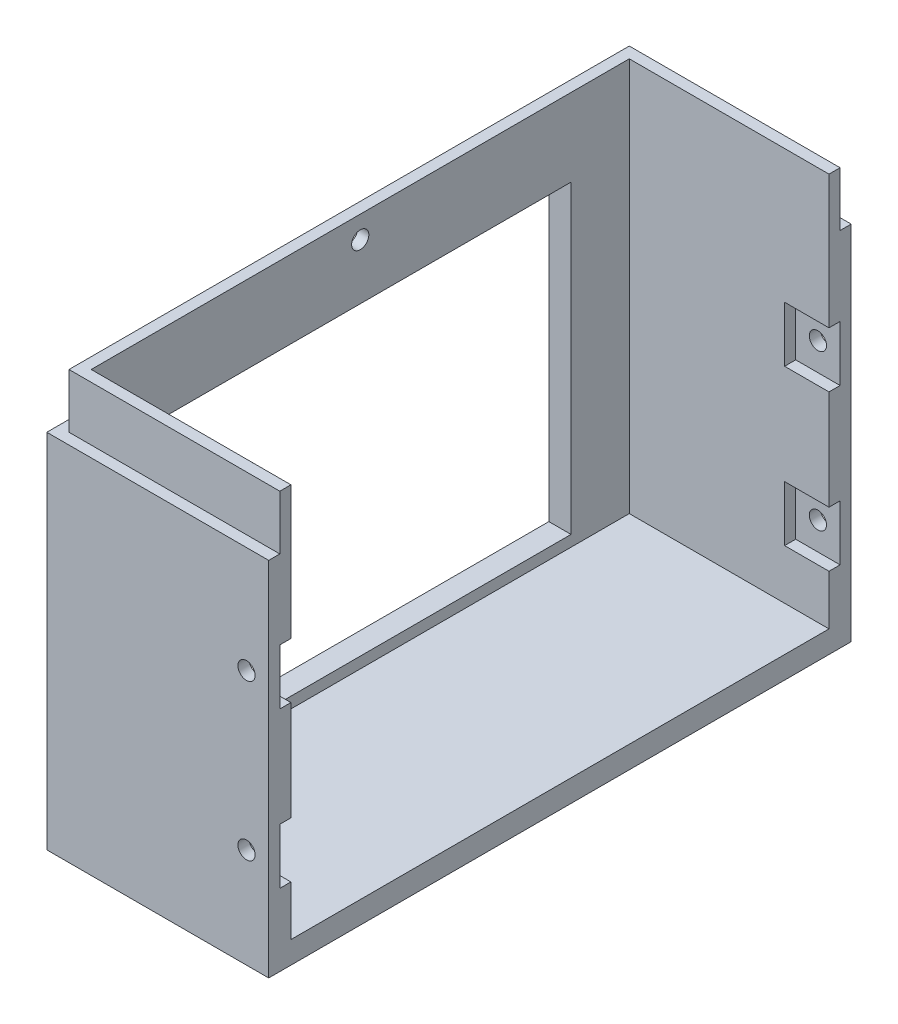
ISO-10303-21;
HEADER;
FILE_DESCRIPTION(('STEP AP214'),'2;1');
FILE_NAME('part.step','',(''),(''),'','','');
FILE_SCHEMA(('AUTOMOTIVE_DESIGN { 1 0 10303 214 1 1 1 1 }'));
ENDSEC;
DATA;
#1=APPLICATION_CONTEXT('core data for automotive mechanical design processes');
#2=APPLICATION_PROTOCOL_DEFINITION('international standard','automotive_design',2000,#1);
#3=PRODUCT_CONTEXT('',#1,'mechanical');
#4=PRODUCT('Part','Part','',(#3));
#5=PRODUCT_RELATED_PRODUCT_CATEGORY('part','',(#4));
#6=PRODUCT_DEFINITION_FORMATION('','',#4);
#7=PRODUCT_DEFINITION_CONTEXT('part definition',#1,'design');
#8=PRODUCT_DEFINITION('design','',#6,#7);
#9=PRODUCT_DEFINITION_SHAPE('','',#8);
#10=(LENGTH_UNIT() NAMED_UNIT(*) SI_UNIT(.MILLI.,.METRE.));
#11=(NAMED_UNIT(*) PLANE_ANGLE_UNIT() SI_UNIT($,.RADIAN.));
#12=(NAMED_UNIT(*) SI_UNIT($,.STERADIAN.) SOLID_ANGLE_UNIT());
#13=UNCERTAINTY_MEASURE_WITH_UNIT(LENGTH_MEASURE(1.E-05),#10,'distance_accuracy_value','');
#14=(GEOMETRIC_REPRESENTATION_CONTEXT(3) GLOBAL_UNCERTAINTY_ASSIGNED_CONTEXT((#13)) GLOBAL_UNIT_ASSIGNED_CONTEXT((#10,
#11,#12)) REPRESENTATION_CONTEXT('',''));
#15=CARTESIAN_POINT('',(0.,0.,0.));
#16=DIRECTION('',(0.,0.,1.));
#17=DIRECTION('',(1.,0.,0.));
#18=AXIS2_PLACEMENT_3D('',#15,#16,#17);
#19=CARTESIAN_POINT('',(16.,46.,52.5));
#20=DIRECTION('',(0.,0.,-1.));
#21=DIRECTION('',(-1.,0.,0.));
#22=AXIS2_PLACEMENT_3D('',#19,#20,#21);
#23=CYLINDRICAL_SURFACE('',#22,1.55);
#24=CARTESIAN_POINT('',(16.,46.,-52.5));
#25=DIRECTION('',(0.,0.,-1.));
#26=DIRECTION('',(-1.,0.,0.));
#27=AXIS2_PLACEMENT_3D('',#24,#25,#26);
#28=CIRCLE('',#27,1.55);
#29=CARTESIAN_POINT('',(14.45,46.,-52.5));
#30=VERTEX_POINT('',#29);
#31=EDGE_CURVE('E413',#30,#30,#28,.T.);
#32=ORIENTED_EDGE('',*,*,#31,.T.);
#33=EDGE_LOOP('',(#32));
#34=FACE_BOUND('',#33,.T.);
#35=CARTESIAN_POINT('',(16.,46.,-50.5));
#36=DIRECTION('',(0.,0.,1.));
#37=DIRECTION('',(1.,0.,0.));
#38=AXIS2_PLACEMENT_3D('',#35,#36,#37);
#39=CIRCLE('',#38,1.55);
#40=CARTESIAN_POINT('',(17.55,46.,-50.5));
#41=VERTEX_POINT('',#40);
#42=EDGE_CURVE('E42',#41,#41,#39,.F.);
#43=ORIENTED_EDGE('',*,*,#42,.F.);
#44=EDGE_LOOP('',(#43));
#45=FACE_BOUND('',#44,.T.);
#46=ADVANCED_FACE('F38',(#34,#45),#23,.F.);
#47=CARTESIAN_POINT('',(16.,18.,52.5));
#48=DIRECTION('',(0.,0.,-1.));
#49=DIRECTION('',(-1.,0.,0.));
#50=AXIS2_PLACEMENT_3D('',#47,#48,#49);
#51=CYLINDRICAL_SURFACE('',#50,1.55);
#52=CARTESIAN_POINT('',(16.,18.,-52.5));
#53=DIRECTION('',(0.,0.,-1.));
#54=DIRECTION('',(-1.,0.,0.));
#55=AXIS2_PLACEMENT_3D('',#52,#53,#54);
#56=CIRCLE('',#55,1.55);
#57=CARTESIAN_POINT('',(14.45,18.,-52.5));
#58=VERTEX_POINT('',#57);
#59=EDGE_CURVE('E405',#58,#58,#56,.T.);
#60=ORIENTED_EDGE('',*,*,#59,.T.);
#61=EDGE_LOOP('',(#60));
#62=FACE_BOUND('',#61,.T.);
#63=CARTESIAN_POINT('',(16.,18.,-50.5));
#64=DIRECTION('',(0.,0.,1.));
#65=DIRECTION('',(1.,0.,0.));
#66=AXIS2_PLACEMENT_3D('',#63,#64,#65);
#67=CIRCLE('',#66,1.55);
#68=CARTESIAN_POINT('',(17.55,18.,-50.5));
#69=VERTEX_POINT('',#68);
#70=EDGE_CURVE('E308',#69,#69,#67,.F.);
#71=ORIENTED_EDGE('',*,*,#70,.F.);
#72=EDGE_LOOP('',(#71));
#73=FACE_BOUND('',#72,.T.);
#74=ADVANCED_FACE('F521',(#62,#73),#51,.F.);
#75=CARTESIAN_POINT('',(16.,46.,52.5));
#76=DIRECTION('',(0.,0.,-1.));
#77=DIRECTION('',(-1.,0.,0.));
#78=AXIS2_PLACEMENT_3D('',#75,#76,#77);
#79=CIRCLE('',#78,1.55);
#80=CARTESIAN_POINT('',(14.45,46.,52.5));
#81=VERTEX_POINT('',#80);
#82=EDGE_CURVE('E409',#81,#81,#79,.T.);
#83=ORIENTED_EDGE('',*,*,#82,.F.);
#84=EDGE_LOOP('',(#83));
#85=FACE_BOUND('',#84,.T.);
#86=CARTESIAN_POINT('',(16.,46.,50.5));
#87=DIRECTION('',(0.,0.,-1.));
#88=DIRECTION('',(0.,1.,0.));
#89=AXIS2_PLACEMENT_3D('',#86,#87,#88);
#90=CIRCLE('',#89,1.55);
#91=CARTESIAN_POINT('',(16.,47.55,50.5));
#92=VERTEX_POINT('',#91);
#93=EDGE_CURVE('E416',#92,#92,#90,.F.);
#94=ORIENTED_EDGE('',*,*,#93,.F.);
#95=EDGE_LOOP('',(#94));
#96=FACE_BOUND('',#95,.T.);
#97=ADVANCED_FACE('F524',(#85,#96),#23,.F.);
#98=CARTESIAN_POINT('',(0.,75.,0.));
#99=DIRECTION('',(0.,1.,0.));
#100=DIRECTION('',(0.,0.,1.));
#101=AXIS2_PLACEMENT_3D('',#98,#99,#100);
#102=PLANE('',#101);
#103=DIRECTION('',(1.,0.,0.));
#104=VECTOR('',#103,1.);
#105=CARTESIAN_POINT('',(20.,75.,-50.5));
#106=LINE('',#105,#104);
#107=CARTESIAN_POINT('',(-18.,75.,-50.5));
#108=VERTEX_POINT('',#107);
#109=CARTESIAN_POINT('',(20.,75.,-50.5));
#110=VERTEX_POINT('',#109);
#111=EDGE_CURVE('E434',#108,#110,#106,.T.);
#112=ORIENTED_EDGE('',*,*,#111,.F.);
#113=DIRECTION('',(0.,0.,-1.));
#114=VECTOR('',#113,1.);
#115=CARTESIAN_POINT('',(-18.,75.,-50.5));
#116=LINE('',#115,#114);
#117=CARTESIAN_POINT('',(-18.,75.,50.5));
#118=VERTEX_POINT('',#117);
#119=EDGE_CURVE('E425',#118,#108,#116,.T.);
#120=ORIENTED_EDGE('',*,*,#119,.F.);
#121=DIRECTION('',(-1.,0.,0.));
#122=VECTOR('',#121,1.);
#123=CARTESIAN_POINT('',(20.,75.,50.5));
#124=LINE('',#123,#122);
#125=CARTESIAN_POINT('',(20.,75.,50.5));
#126=VERTEX_POINT('',#125);
#127=EDGE_CURVE('E443',#126,#118,#124,.T.);
#128=ORIENTED_EDGE('',*,*,#127,.F.);
#129=DIRECTION('',(0.,0.,-1.));
#130=VECTOR('',#129,1.);
#131=CARTESIAN_POINT('',(20.,75.,-52.5));
#132=LINE('',#131,#130);
#133=CARTESIAN_POINT('',(20.,75.,48.5));
#134=VERTEX_POINT('',#133);
#135=EDGE_CURVE('E490',#126,#134,#132,.T.);
#136=ORIENTED_EDGE('',*,*,#135,.T.);
#137=DIRECTION('',(1.,0.,0.));
#138=VECTOR('',#137,1.);
#139=CARTESIAN_POINT('',(-16.,75.,48.5));
#140=LINE('',#139,#138);
#141=CARTESIAN_POINT('',(-16.,75.,48.5));
#142=VERTEX_POINT('',#141);
#143=EDGE_CURVE('E479',#142,#134,#140,.T.);
#144=ORIENTED_EDGE('',*,*,#143,.F.);
#145=DIRECTION('',(0.,0.,1.));
#146=VECTOR('',#145,1.);
#147=CARTESIAN_POINT('',(-16.,75.,48.5));
#148=LINE('',#147,#146);
#149=CARTESIAN_POINT('',(-16.,75.,-48.5));
#150=VERTEX_POINT('',#149);
#151=EDGE_CURVE('E464',#150,#142,#148,.T.);
#152=ORIENTED_EDGE('',*,*,#151,.F.);
#153=DIRECTION('',(1.,0.,0.));
#154=VECTOR('',#153,1.);
#155=CARTESIAN_POINT('',(-16.,75.,-48.5));
#156=LINE('',#155,#154);
#157=CARTESIAN_POINT('',(20.,75.,-48.5));
#158=VERTEX_POINT('',#157);
#159=EDGE_CURVE('E483',#150,#158,#156,.T.);
#160=ORIENTED_EDGE('',*,*,#159,.T.);
#161=EDGE_CURVE('E493',#158,#110,#132,.T.);
#162=ORIENTED_EDGE('',*,*,#161,.T.);
#163=EDGE_LOOP('',(#112,#120,#128,#136,#144,#152,#160,#162));
#164=FACE_BOUND('',#163,.T.);
#165=ADVANCED_FACE('F533',(#164),#102,.T.);
#166=CARTESIAN_POINT('',(0.,0.,50.5));
#167=DIRECTION('',(0.,0.,-1.));
#168=DIRECTION('',(-1.,0.,0.));
#169=AXIS2_PLACEMENT_3D('',#166,#167,#168);
#170=PLANE('',#169);
#171=DIRECTION('',(0.,1.,0.));
#172=VECTOR('',#171,1.);
#173=CARTESIAN_POINT('',(-18.,75.,50.5));
#174=LINE('',#173,#172);
#175=CARTESIAN_POINT('',(-18.,65.2,50.5));
#176=VERTEX_POINT('',#175);
#177=EDGE_CURVE('E423',#176,#118,#174,.T.);
#178=ORIENTED_EDGE('',*,*,#177,.F.);
#179=DIRECTION('',(1.,0.,0.));
#180=VECTOR('',#179,1.);
#181=CARTESIAN_POINT('',(20.,65.2,50.5));
#182=LINE('',#181,#180);
#183=CARTESIAN_POINT('',(20.,65.2,50.5));
#184=VERTEX_POINT('',#183);
#185=EDGE_CURVE('E446',#176,#184,#182,.T.);
#186=ORIENTED_EDGE('',*,*,#185,.T.);
#187=DIRECTION('',(0.,1.,0.));
#188=VECTOR('',#187,1.);
#189=CARTESIAN_POINT('',(20.,75.,50.5));
#190=LINE('',#189,#188);
#191=EDGE_CURVE('E441',#184,#126,#190,.T.);
#192=ORIENTED_EDGE('',*,*,#191,.T.);
#193=ORIENTED_EDGE('',*,*,#127,.T.);
#194=EDGE_LOOP('',(#178,#186,#192,#193));
#195=FACE_BOUND('',#194,.T.);
#196=ADVANCED_FACE('F538',(#195),#170,.F.);
#197=CARTESIAN_POINT('',(0.,0.,-50.5));
#198=DIRECTION('',(0.,0.,-1.));
#199=DIRECTION('',(-1.,0.,0.));
#200=AXIS2_PLACEMENT_3D('',#197,#198,#199);
#201=PLANE('',#200);
#202=DIRECTION('',(-1.,0.,0.));
#203=VECTOR('',#202,1.);
#204=CARTESIAN_POINT('',(20.,65.2,-50.5));
#205=LINE('',#204,#203);
#206=CARTESIAN_POINT('',(20.,65.2,-50.5));
#207=VERTEX_POINT('',#206);
#208=CARTESIAN_POINT('',(-18.,65.2,-50.5));
#209=VERTEX_POINT('',#208);
#210=EDGE_CURVE('E431',#207,#209,#205,.T.);
#211=ORIENTED_EDGE('',*,*,#210,.T.);
#212=DIRECTION('',(0.,-1.,0.));
#213=VECTOR('',#212,1.);
#214=CARTESIAN_POINT('',(-18.,75.,-50.5));
#215=LINE('',#214,#213);
#216=EDGE_CURVE('E412',#108,#209,#215,.T.);
#217=ORIENTED_EDGE('',*,*,#216,.F.);
#218=ORIENTED_EDGE('',*,*,#111,.T.);
#219=DIRECTION('',(0.,-1.,0.));
#220=VECTOR('',#219,1.);
#221=CARTESIAN_POINT('',(20.,75.,-50.5));
#222=LINE('',#221,#220);
#223=EDGE_CURVE('E428',#110,#207,#222,.T.);
#224=ORIENTED_EDGE('',*,*,#223,.T.);
#225=EDGE_LOOP('',(#211,#217,#218,#224));
#226=FACE_BOUND('',#225,.T.);
#227=ADVANCED_FACE('F621',(#226),#201,.T.);
#228=CARTESIAN_POINT('',(20.,75.,-52.5));
#229=DIRECTION('',(-1.,0.,0.));
#230=DIRECTION('',(0.,0.,1.));
#231=AXIS2_PLACEMENT_3D('',#228,#229,#230);
#232=PLANE('',#231);
#233=DIRECTION('',(0.,1.,0.));
#234=VECTOR('',#233,1.);
#235=CARTESIAN_POINT('',(20.,51.,-50.5));
#236=LINE('',#235,#234);
#237=CARTESIAN_POINT('',(20.,41.,-50.5));
#238=VERTEX_POINT('',#237);
#239=CARTESIAN_POINT('',(20.,51.,-50.5));
#240=VERTEX_POINT('',#239);
#241=EDGE_CURVE('E283',#238,#240,#236,.T.);
#242=ORIENTED_EDGE('',*,*,#241,.F.);
#243=DIRECTION('',(0.,0.,1.));
#244=VECTOR('',#243,1.);
#245=CARTESIAN_POINT('',(20.,41.,-50.5));
#246=LINE('',#245,#244);
#247=CARTESIAN_POINT('',(20.,41.,-48.5));
#248=VERTEX_POINT('',#247);
#249=EDGE_CURVE('E305',#238,#248,#246,.T.);
#250=ORIENTED_EDGE('',*,*,#249,.T.);
#251=DIRECTION('',(0.,1.,0.));
#252=VECTOR('',#251,1.);
#253=CARTESIAN_POINT('',(20.,75.,-48.5));
#254=LINE('',#253,#252);
#255=CARTESIAN_POINT('',(20.,23.,-48.5));
#256=VERTEX_POINT('',#255);
#257=EDGE_CURVE('E478',#256,#248,#254,.T.);
#258=ORIENTED_EDGE('',*,*,#257,.F.);
#259=DIRECTION('',(0.,0.,1.));
#260=VECTOR('',#259,1.);
#261=CARTESIAN_POINT('',(20.,23.,-50.5));
#262=LINE('',#261,#260);
#263=CARTESIAN_POINT('',(20.,23.,-50.5));
#264=VERTEX_POINT('',#263);
#265=EDGE_CURVE('E327',#264,#256,#262,.T.);
#266=ORIENTED_EDGE('',*,*,#265,.F.);
#267=DIRECTION('',(0.,1.,0.));
#268=VECTOR('',#267,1.);
#269=CARTESIAN_POINT('',(20.,23.,-50.5));
#270=LINE('',#269,#268);
#271=CARTESIAN_POINT('',(20.,13.,-50.5));
#272=VERTEX_POINT('',#271);
#273=EDGE_CURVE('E314',#272,#264,#270,.T.);
#274=ORIENTED_EDGE('',*,*,#273,.F.);
#275=DIRECTION('',(0.,0.,1.));
#276=VECTOR('',#275,1.);
#277=CARTESIAN_POINT('',(20.,13.,-50.5));
#278=LINE('',#277,#276);
#279=CARTESIAN_POINT('',(20.,13.,-48.5));
#280=VERTEX_POINT('',#279);
#281=EDGE_CURVE('E301',#272,#280,#278,.T.);
#282=ORIENTED_EDGE('',*,*,#281,.T.);
#283=CARTESIAN_POINT('',(20.,4.,-48.5));
#284=VERTEX_POINT('',#283);
#285=EDGE_CURVE('E459',#284,#280,#254,.T.);
#286=ORIENTED_EDGE('',*,*,#285,.F.);
#287=DIRECTION('',(0.,0.,-1.));
#288=VECTOR('',#287,1.);
#289=CARTESIAN_POINT('',(20.,4.,48.5));
#290=LINE('',#289,#288);
#291=CARTESIAN_POINT('',(20.,4.,48.5));
#292=VERTEX_POINT('',#291);
#293=EDGE_CURVE('E471',#292,#284,#290,.T.);
#294=ORIENTED_EDGE('',*,*,#293,.F.);
#295=DIRECTION('',(0.,-1.,0.));
#296=VECTOR('',#295,1.);
#297=CARTESIAN_POINT('',(20.,75.,48.5));
#298=LINE('',#297,#296);
#299=CARTESIAN_POINT('',(20.,13.,48.5));
#300=VERTEX_POINT('',#299);
#301=EDGE_CURVE('E453',#300,#292,#298,.T.);
#302=ORIENTED_EDGE('',*,*,#301,.F.);
#303=DIRECTION('',(0.,0.,-1.));
#304=VECTOR('',#303,1.);
#305=CARTESIAN_POINT('',(20.,13.,50.5));
#306=LINE('',#305,#304);
#307=CARTESIAN_POINT('',(20.,13.,50.5));
#308=VERTEX_POINT('',#307);
#309=EDGE_CURVE('E361',#308,#300,#306,.T.);
#310=ORIENTED_EDGE('',*,*,#309,.F.);
#311=DIRECTION('',(0.,-1.,0.));
#312=VECTOR('',#311,1.);
#313=CARTESIAN_POINT('',(20.,23.,50.5));
#314=LINE('',#313,#312);
#315=CARTESIAN_POINT('',(20.,23.,50.5));
#316=VERTEX_POINT('',#315);
#317=EDGE_CURVE('E348',#316,#308,#314,.T.);
#318=ORIENTED_EDGE('',*,*,#317,.F.);
#319=DIRECTION('',(0.,0.,-1.));
#320=VECTOR('',#319,1.);
#321=CARTESIAN_POINT('',(20.,23.,50.5));
#322=LINE('',#321,#320);
#323=CARTESIAN_POINT('',(20.,23.,48.5));
#324=VERTEX_POINT('',#323);
#325=EDGE_CURVE('E370',#316,#324,#322,.T.);
#326=ORIENTED_EDGE('',*,*,#325,.T.);
#327=CARTESIAN_POINT('',(20.,41.,48.5));
#328=VERTEX_POINT('',#327);
#329=EDGE_CURVE('E472',#328,#324,#298,.T.);
#330=ORIENTED_EDGE('',*,*,#329,.F.);
#331=DIRECTION('',(0.,0.,-1.));
#332=VECTOR('',#331,1.);
#333=CARTESIAN_POINT('',(20.,41.,50.5));
#334=LINE('',#333,#332);
#335=CARTESIAN_POINT('',(20.,41.,50.5));
#336=VERTEX_POINT('',#335);
#337=EDGE_CURVE('E398',#336,#328,#334,.T.);
#338=ORIENTED_EDGE('',*,*,#337,.F.);
#339=DIRECTION('',(0.,-1.,0.));
#340=VECTOR('',#339,1.);
#341=CARTESIAN_POINT('',(20.,51.,50.5));
#342=LINE('',#341,#340);
#343=CARTESIAN_POINT('',(20.,51.,50.5));
#344=VERTEX_POINT('',#343);
#345=EDGE_CURVE('E386',#344,#336,#342,.T.);
#346=ORIENTED_EDGE('',*,*,#345,.F.);
#347=DIRECTION('',(0.,0.,-1.));
#348=VECTOR('',#347,1.);
#349=CARTESIAN_POINT('',(20.,51.,50.5));
#350=LINE('',#349,#348);
#351=CARTESIAN_POINT('',(20.,51.,48.5));
#352=VERTEX_POINT('',#351);
#353=EDGE_CURVE('E400',#344,#352,#350,.T.);
#354=ORIENTED_EDGE('',*,*,#353,.T.);
#355=EDGE_CURVE('E468',#134,#352,#298,.T.);
#356=ORIENTED_EDGE('',*,*,#355,.F.);
#357=ORIENTED_EDGE('',*,*,#135,.F.);
#358=ORIENTED_EDGE('',*,*,#191,.F.);
#359=DIRECTION('',(0.,0.,1.));
#360=VECTOR('',#359,1.);
#361=CARTESIAN_POINT('',(20.,65.2,50.5));
#362=LINE('',#361,#360);
#363=CARTESIAN_POINT('',(20.,65.2,52.5));
#364=VERTEX_POINT('',#363);
#365=EDGE_CURVE('E450',#184,#364,#362,.T.);
#366=ORIENTED_EDGE('',*,*,#365,.T.);
#367=DIRECTION('',(0.,-1.,0.));
#368=VECTOR('',#367,1.);
#369=CARTESIAN_POINT('',(20.,75.,52.5));
#370=LINE('',#369,#368);
#371=CARTESIAN_POINT('',(20.,0.,52.5));
#372=VERTEX_POINT('',#371);
#373=EDGE_CURVE('E492',#364,#372,#370,.T.);
#374=ORIENTED_EDGE('',*,*,#373,.T.);
#375=DIRECTION('',(0.,0.,-1.));
#376=VECTOR('',#375,1.);
#377=CARTESIAN_POINT('',(20.,0.,-52.5));
#378=LINE('',#377,#376);
#379=CARTESIAN_POINT('',(20.,0.,-52.5));
#380=VERTEX_POINT('',#379);
#381=EDGE_CURVE('E482',#372,#380,#378,.T.);
#382=ORIENTED_EDGE('',*,*,#381,.T.);
#383=DIRECTION('',(0.,-1.,0.));
#384=VECTOR('',#383,1.);
#385=CARTESIAN_POINT('',(20.,75.,-52.5));
#386=LINE('',#385,#384);
#387=CARTESIAN_POINT('',(20.,65.2,-52.5));
#388=VERTEX_POINT('',#387);
#389=EDGE_CURVE('E11',#388,#380,#386,.T.);
#390=ORIENTED_EDGE('',*,*,#389,.F.);
#391=DIRECTION('',(0.,0.,-1.));
#392=VECTOR('',#391,1.);
#393=CARTESIAN_POINT('',(20.,65.2,-50.5));
#394=LINE('',#393,#392);
#395=EDGE_CURVE('E436',#207,#388,#394,.T.);
#396=ORIENTED_EDGE('',*,*,#395,.F.);
#397=ORIENTED_EDGE('',*,*,#223,.F.);
#398=ORIENTED_EDGE('',*,*,#161,.F.);
#399=CARTESIAN_POINT('',(20.,51.,-48.5));
#400=VERTEX_POINT('',#399);
#401=EDGE_CURVE('E475',#400,#158,#254,.T.);
#402=ORIENTED_EDGE('',*,*,#401,.F.);
#403=DIRECTION('',(0.,0.,1.));
#404=VECTOR('',#403,1.);
#405=CARTESIAN_POINT('',(20.,51.,-50.5));
#406=LINE('',#405,#404);
#407=EDGE_CURVE('E296',#240,#400,#406,.T.);
#408=ORIENTED_EDGE('',*,*,#407,.F.);
#409=EDGE_LOOP('',(#242,#250,#258,#266,#274,#282,#286,#294,#302,#310,#318,#326,#330,#338,#346,
#354,#356,#357,#358,#366,#374,#382,#390,#396,#397,#398,#402,#408));
#410=FACE_BOUND('',#409,.T.);
#411=ADVANCED_FACE('F40',(#410),#232,.F.);
#412=CARTESIAN_POINT('',(-20.,75.,-52.5));
#413=DIRECTION('',(0.,0.,1.));
#414=DIRECTION('',(1.,0.,0.));
#415=AXIS2_PLACEMENT_3D('',#412,#413,#414);
#416=PLANE('',#415);
#417=ORIENTED_EDGE('',*,*,#59,.F.);
#418=EDGE_LOOP('',(#417));
#419=FACE_BOUND('',#418,.T.);
#420=ORIENTED_EDGE('',*,*,#31,.F.);
#421=EDGE_LOOP('',(#420));
#422=FACE_BOUND('',#421,.T.);
#423=DIRECTION('',(0.,-1.,0.));
#424=VECTOR('',#423,1.);
#425=CARTESIAN_POINT('',(-20.,75.,-52.5));
#426=LINE('',#425,#424);
#427=CARTESIAN_POINT('',(-20.,65.2,-52.5));
#428=VERTEX_POINT('',#427);
#429=CARTESIAN_POINT('',(-20.,0.,-52.5));
#430=VERTEX_POINT('',#429);
#431=EDGE_CURVE('E47',#428,#430,#426,.T.);
#432=ORIENTED_EDGE('',*,*,#431,.F.);
#433=DIRECTION('',(-1.,0.,0.));
#434=VECTOR('',#433,1.);
#435=CARTESIAN_POINT('',(20.,65.2,-52.5));
#436=LINE('',#435,#434);
#437=EDGE_CURVE('E427',#388,#428,#436,.T.);
#438=ORIENTED_EDGE('',*,*,#437,.F.);
#439=ORIENTED_EDGE('',*,*,#389,.T.);
#440=DIRECTION('',(-1.,0.,0.));
#441=VECTOR('',#440,1.);
#442=CARTESIAN_POINT('',(-20.,0.,-52.5));
#443=LINE('',#442,#441);
#444=EDGE_CURVE('E496',#380,#430,#443,.T.);
#445=ORIENTED_EDGE('',*,*,#444,.T.);
#446=EDGE_LOOP('',(#432,#438,#439,#445));
#447=FACE_BOUND('',#446,.T.);
#448=ADVANCED_FACE('F614',(#419,#422,#447),#416,.F.);
#449=CARTESIAN_POINT('',(-20.,75.,-52.5));
#450=DIRECTION('',(1.,0.,0.));
#451=DIRECTION('',(0.,0.,-1.));
#452=AXIS2_PLACEMENT_3D('',#449,#450,#451);
#453=PLANE('',#452);
#454=DIRECTION('',(0.,0.,-1.));
#455=VECTOR('',#454,1.);
#456=CARTESIAN_POINT('',(-20.,61.,-38.));
#457=LINE('',#456,#455);
#458=CARTESIAN_POINT('',(-20.,61.,38.));
#459=VERTEX_POINT('',#458);
#460=CARTESIAN_POINT('',(-20.,61.,-38.));
#461=VERTEX_POINT('',#460);
#462=EDGE_CURVE('E267',#459,#461,#457,.T.);
#463=ORIENTED_EDGE('',*,*,#462,.F.);
#464=DIRECTION('',(0.,1.,0.));
#465=VECTOR('',#464,1.);
#466=CARTESIAN_POINT('',(-20.,61.,38.));
#467=LINE('',#466,#465);
#468=CARTESIAN_POINT('',(-20.,6.,38.));
#469=VERTEX_POINT('',#468);
#470=EDGE_CURVE('E55',#469,#459,#467,.T.);
#471=ORIENTED_EDGE('',*,*,#470,.F.);
#472=DIRECTION('',(0.,0.,1.));
#473=VECTOR('',#472,1.);
#474=CARTESIAN_POINT('',(-20.,6.,-38.));
#475=LINE('',#474,#473);
#476=CARTESIAN_POINT('',(-20.,6.,-38.));
#477=VERTEX_POINT('',#476);
#478=EDGE_CURVE('E260',#477,#469,#475,.T.);
#479=ORIENTED_EDGE('',*,*,#478,.F.);
#480=DIRECTION('',(0.,-1.,0.));
#481=VECTOR('',#480,1.);
#482=CARTESIAN_POINT('',(-20.,61.,-38.));
#483=LINE('',#482,#481);
#484=EDGE_CURVE('E274',#461,#477,#483,.T.);
#485=ORIENTED_EDGE('',*,*,#484,.F.);
#486=EDGE_LOOP('',(#463,#471,#479,#485));
#487=FACE_BOUND('',#486,.T.);
#488=DIRECTION('',(0.,0.,1.));
#489=VECTOR('',#488,1.);
#490=CARTESIAN_POINT('',(-20.,65.2,50.5));
#491=LINE('',#490,#489);
#492=CARTESIAN_POINT('',(-20.,65.2,52.5));
#493=VERTEX_POINT('',#492);
#494=EDGE_CURVE('E448',#428,#493,#491,.T.);
#495=ORIENTED_EDGE('',*,*,#494,.F.);
#496=ORIENTED_EDGE('',*,*,#431,.T.);
#497=DIRECTION('',(0.,0.,1.));
#498=VECTOR('',#497,1.);
#499=CARTESIAN_POINT('',(-20.,0.,-52.5));
#500=LINE('',#499,#498);
#501=CARTESIAN_POINT('',(-20.,0.,52.5));
#502=VERTEX_POINT('',#501);
#503=EDGE_CURVE('E499',#430,#502,#500,.T.);
#504=ORIENTED_EDGE('',*,*,#503,.T.);
#505=DIRECTION('',(0.,-1.,0.));
#506=VECTOR('',#505,1.);
#507=CARTESIAN_POINT('',(-20.,75.,52.5));
#508=LINE('',#507,#506);
#509=EDGE_CURVE('E506',#493,#502,#508,.T.);
#510=ORIENTED_EDGE('',*,*,#509,.F.);
#511=EDGE_LOOP('',(#495,#496,#504,#510));
#512=FACE_BOUND('',#511,.T.);
#513=ADVANCED_FACE('F591',(#487,#512),#453,.F.);
#514=CARTESIAN_POINT('',(-20.,75.,52.5));
#515=DIRECTION('',(0.,0.,-1.));
#516=DIRECTION('',(-1.,0.,0.));
#517=AXIS2_PLACEMENT_3D('',#514,#515,#516);
#518=PLANE('',#517);
#519=CARTESIAN_POINT('',(16.,18.,52.5));
#520=DIRECTION('',(0.,0.,-1.));
#521=DIRECTION('',(-1.,0.,0.));
#522=AXIS2_PLACEMENT_3D('',#519,#520,#521);
#523=CIRCLE('',#522,1.55);
#524=CARTESIAN_POINT('',(14.45,18.,52.5));
#525=VERTEX_POINT('',#524);
#526=EDGE_CURVE('E408',#525,#525,#523,.T.);
#527=ORIENTED_EDGE('',*,*,#526,.T.);
#528=EDGE_LOOP('',(#527));
#529=FACE_BOUND('',#528,.T.);
#530=ORIENTED_EDGE('',*,*,#82,.T.);
#531=EDGE_LOOP('',(#530));
#532=FACE_BOUND('',#531,.T.);
#533=ORIENTED_EDGE('',*,*,#373,.F.);
#534=DIRECTION('',(1.,0.,0.));
#535=VECTOR('',#534,1.);
#536=CARTESIAN_POINT('',(20.,65.2,52.5));
#537=LINE('',#536,#535);
#538=EDGE_CURVE('E440',#493,#364,#537,.T.);
#539=ORIENTED_EDGE('',*,*,#538,.F.);
#540=ORIENTED_EDGE('',*,*,#509,.T.);
#541=DIRECTION('',(1.,0.,0.));
#542=VECTOR('',#541,1.);
#543=CARTESIAN_POINT('',(-20.,0.,52.5));
#544=LINE('',#543,#542);
#545=EDGE_CURVE('E502',#502,#372,#544,.T.);
#546=ORIENTED_EDGE('',*,*,#545,.T.);
#547=EDGE_LOOP('',(#533,#539,#540,#546));
#548=FACE_BOUND('',#547,.T.);
#549=ADVANCED_FACE('F587',(#529,#532,#548),#518,.F.);
#550=CARTESIAN_POINT('',(0.,0.,0.));
#551=DIRECTION('',(0.,1.,0.));
#552=DIRECTION('',(0.,0.,1.));
#553=AXIS2_PLACEMENT_3D('',#550,#551,#552);
#554=PLANE('',#553);
#555=ORIENTED_EDGE('',*,*,#381,.F.);
#556=ORIENTED_EDGE('',*,*,#545,.F.);
#557=ORIENTED_EDGE('',*,*,#503,.F.);
#558=ORIENTED_EDGE('',*,*,#444,.F.);
#559=EDGE_LOOP('',(#555,#556,#557,#558));
#560=FACE_BOUND('',#559,.T.);
#561=ADVANCED_FACE('F590',(#560),#554,.F.);
#562=CARTESIAN_POINT('',(-16.,75.,48.5));
#563=DIRECTION('',(0.,0.,1.));
#564=DIRECTION('',(1.,0.,0.));
#565=AXIS2_PLACEMENT_3D('',#562,#563,#564);
#566=PLANE('',#565);
#567=ORIENTED_EDGE('',*,*,#329,.T.);
#568=DIRECTION('',(1.,0.,0.));
#569=VECTOR('',#568,1.);
#570=CARTESIAN_POINT('',(12.,23.,48.5));
#571=LINE('',#570,#569);
#572=CARTESIAN_POINT('',(12.,23.,48.5));
#573=VERTEX_POINT('',#572);
#574=EDGE_CURVE('E352',#573,#324,#571,.T.);
#575=ORIENTED_EDGE('',*,*,#574,.F.);
#576=DIRECTION('',(0.,1.,0.));
#577=VECTOR('',#576,1.);
#578=CARTESIAN_POINT('',(12.,23.,48.5));
#579=LINE('',#578,#577);
#580=CARTESIAN_POINT('',(12.,13.,48.5));
#581=VERTEX_POINT('',#580);
#582=EDGE_CURVE('E365',#581,#573,#579,.T.);
#583=ORIENTED_EDGE('',*,*,#582,.F.);
#584=DIRECTION('',(-1.,0.,0.));
#585=VECTOR('',#584,1.);
#586=CARTESIAN_POINT('',(12.,13.,48.5));
#587=LINE('',#586,#585);
#588=EDGE_CURVE('E362',#300,#581,#587,.T.);
#589=ORIENTED_EDGE('',*,*,#588,.F.);
#590=ORIENTED_EDGE('',*,*,#301,.T.);
#591=DIRECTION('',(1.,0.,0.));
#592=VECTOR('',#591,1.);
#593=CARTESIAN_POINT('',(-16.,4.,48.5));
#594=LINE('',#593,#592);
#595=CARTESIAN_POINT('',(-16.,4.,48.5));
#596=VERTEX_POINT('',#595);
#597=EDGE_CURVE('E467',#596,#292,#594,.T.);
#598=ORIENTED_EDGE('',*,*,#597,.F.);
#599=DIRECTION('',(0.,-1.,0.));
#600=VECTOR('',#599,1.);
#601=CARTESIAN_POINT('',(-16.,75.,48.5));
#602=LINE('',#601,#600);
#603=EDGE_CURVE('E455',#142,#596,#602,.T.);
#604=ORIENTED_EDGE('',*,*,#603,.F.);
#605=ORIENTED_EDGE('',*,*,#143,.T.);
#606=ORIENTED_EDGE('',*,*,#355,.T.);
#607=DIRECTION('',(1.,0.,0.));
#608=VECTOR('',#607,1.);
#609=CARTESIAN_POINT('',(20.,51.,48.5));
#610=LINE('',#609,#608);
#611=CARTESIAN_POINT('',(12.,51.,48.5));
#612=VERTEX_POINT('',#611);
#613=EDGE_CURVE('E393',#612,#352,#610,.T.);
#614=ORIENTED_EDGE('',*,*,#613,.F.);
#615=DIRECTION('',(0.,1.,0.));
#616=VECTOR('',#615,1.);
#617=CARTESIAN_POINT('',(12.,51.,48.5));
#618=LINE('',#617,#616);
#619=CARTESIAN_POINT('',(12.,41.,48.5));
#620=VERTEX_POINT('',#619);
#621=EDGE_CURVE('E344',#620,#612,#618,.T.);
#622=ORIENTED_EDGE('',*,*,#621,.F.);
#623=DIRECTION('',(-1.,0.,0.));
#624=VECTOR('',#623,1.);
#625=CARTESIAN_POINT('',(20.,41.,48.5));
#626=LINE('',#625,#624);
#627=EDGE_CURVE('E383',#328,#620,#626,.T.);
#628=ORIENTED_EDGE('',*,*,#627,.F.);
#629=EDGE_LOOP('',(#567,#575,#583,#589,#590,#598,#604,#605,#606,#614,#622,#628));
#630=FACE_BOUND('',#629,.T.);
#631=ADVANCED_FACE('F691',(#630),#566,.F.);
#632=CARTESIAN_POINT('',(-16.,75.,-48.5));
#633=DIRECTION('',(0.,0.,-1.));
#634=DIRECTION('',(-1.,0.,0.));
#635=AXIS2_PLACEMENT_3D('',#632,#633,#634);
#636=PLANE('',#635);
#637=ORIENTED_EDGE('',*,*,#257,.T.);
#638=DIRECTION('',(1.,0.,0.));
#639=VECTOR('',#638,1.);
#640=CARTESIAN_POINT('',(12.,41.,-48.5));
#641=LINE('',#640,#639);
#642=CARTESIAN_POINT('',(12.,41.,-48.5));
#643=VERTEX_POINT('',#642);
#644=EDGE_CURVE('E287',#643,#248,#641,.T.);
#645=ORIENTED_EDGE('',*,*,#644,.F.);
#646=DIRECTION('',(0.,-1.,0.));
#647=VECTOR('',#646,1.);
#648=CARTESIAN_POINT('',(12.,51.,-48.5));
#649=LINE('',#648,#647);
#650=CARTESIAN_POINT('',(12.,51.,-48.5));
#651=VERTEX_POINT('',#650);
#652=EDGE_CURVE('E300',#651,#643,#649,.T.);
#653=ORIENTED_EDGE('',*,*,#652,.F.);
#654=DIRECTION('',(-1.,0.,0.));
#655=VECTOR('',#654,1.);
#656=CARTESIAN_POINT('',(12.,51.,-48.5));
#657=LINE('',#656,#655);
#658=EDGE_CURVE('E297',#400,#651,#657,.T.);
#659=ORIENTED_EDGE('',*,*,#658,.F.);
#660=ORIENTED_EDGE('',*,*,#401,.T.);
#661=ORIENTED_EDGE('',*,*,#159,.F.);
#662=DIRECTION('',(0.,1.,0.));
#663=VECTOR('',#662,1.);
#664=CARTESIAN_POINT('',(-16.,75.,-48.5));
#665=LINE('',#664,#663);
#666=CARTESIAN_POINT('',(-16.,4.,-48.5));
#667=VERTEX_POINT('',#666);
#668=EDGE_CURVE('E462',#667,#150,#665,.T.);
#669=ORIENTED_EDGE('',*,*,#668,.F.);
#670=DIRECTION('',(1.,0.,0.));
#671=VECTOR('',#670,1.);
#672=CARTESIAN_POINT('',(-16.,4.,-48.5));
#673=LINE('',#672,#671);
#674=EDGE_CURVE('E486',#667,#284,#673,.T.);
#675=ORIENTED_EDGE('',*,*,#674,.T.);
#676=ORIENTED_EDGE('',*,*,#285,.T.);
#677=DIRECTION('',(1.,0.,0.));
#678=VECTOR('',#677,1.);
#679=CARTESIAN_POINT('',(12.,13.,-48.5));
#680=LINE('',#679,#678);
#681=CARTESIAN_POINT('',(12.,13.,-48.5));
#682=VERTEX_POINT('',#681);
#683=EDGE_CURVE('E318',#682,#280,#680,.T.);
#684=ORIENTED_EDGE('',*,*,#683,.F.);
#685=DIRECTION('',(0.,-1.,0.));
#686=VECTOR('',#685,1.);
#687=CARTESIAN_POINT('',(12.,23.,-48.5));
#688=LINE('',#687,#686);
#689=CARTESIAN_POINT('',(12.,23.,-48.5));
#690=VERTEX_POINT('',#689);
#691=EDGE_CURVE('E330',#690,#682,#688,.T.);
#692=ORIENTED_EDGE('',*,*,#691,.F.);
#693=DIRECTION('',(-1.,0.,0.));
#694=VECTOR('',#693,1.);
#695=CARTESIAN_POINT('',(12.,23.,-48.5));
#696=LINE('',#695,#694);
#697=EDGE_CURVE('E254',#256,#690,#696,.T.);
#698=ORIENTED_EDGE('',*,*,#697,.F.);
#699=EDGE_LOOP('',(#637,#645,#653,#659,#660,#661,#669,#675,#676,#684,#692,#698));
#700=FACE_BOUND('',#699,.T.);
#701=ADVANCED_FACE('F635',(#700),#636,.F.);
#702=CARTESIAN_POINT('',(-16.,4.,48.5));
#703=DIRECTION('',(0.,-1.,0.));
#704=DIRECTION('',(0.,0.,-1.));
#705=AXIS2_PLACEMENT_3D('',#702,#703,#704);
#706=PLANE('',#705);
#707=ORIENTED_EDGE('',*,*,#293,.T.);
#708=ORIENTED_EDGE('',*,*,#674,.F.);
#709=DIRECTION('',(0.,0.,-1.));
#710=VECTOR('',#709,1.);
#711=CARTESIAN_POINT('',(-16.,4.,48.5));
#712=LINE('',#711,#710);
#713=EDGE_CURVE('E458',#596,#667,#712,.T.);
#714=ORIENTED_EDGE('',*,*,#713,.F.);
#715=ORIENTED_EDGE('',*,*,#597,.T.);
#716=EDGE_LOOP('',(#707,#708,#714,#715));
#717=FACE_BOUND('',#716,.T.);
#718=ADVANCED_FACE('F703',(#717),#706,.F.);
#719=CARTESIAN_POINT('',(-16.,0.,0.));
#720=DIRECTION('',(1.,0.,0.));
#721=DIRECTION('',(0.,0.,-1.));
#722=AXIS2_PLACEMENT_3D('',#719,#720,#721);
#723=PLANE('',#722);
#724=DIRECTION('',(0.,1.,0.));
#725=VECTOR('',#724,1.);
#726=CARTESIAN_POINT('',(-16.,61.,38.));
#727=LINE('',#726,#725);
#728=CARTESIAN_POINT('',(-16.,6.,38.));
#729=VERTEX_POINT('',#728);
#730=CARTESIAN_POINT('',(-16.,61.,38.));
#731=VERTEX_POINT('',#730);
#732=EDGE_CURVE('E258',#729,#731,#727,.T.);
#733=ORIENTED_EDGE('',*,*,#732,.T.);
#734=DIRECTION('',(0.,0.,-1.));
#735=VECTOR('',#734,1.);
#736=CARTESIAN_POINT('',(-16.,61.,-38.));
#737=LINE('',#736,#735);
#738=CARTESIAN_POINT('',(-16.,61.,-38.));
#739=VERTEX_POINT('',#738);
#740=EDGE_CURVE('E247',#731,#739,#737,.T.);
#741=ORIENTED_EDGE('',*,*,#740,.T.);
#742=DIRECTION('',(0.,-1.,0.));
#743=VECTOR('',#742,1.);
#744=CARTESIAN_POINT('',(-16.,61.,-38.));
#745=LINE('',#744,#743);
#746=CARTESIAN_POINT('',(-16.,6.00000000000001,-38.));
#747=VERTEX_POINT('',#746);
#748=EDGE_CURVE('E269',#739,#747,#745,.T.);
#749=ORIENTED_EDGE('',*,*,#748,.T.);
#750=DIRECTION('',(0.,0.,1.));
#751=VECTOR('',#750,1.);
#752=CARTESIAN_POINT('',(-16.,6.,-38.));
#753=LINE('',#752,#751);
#754=EDGE_CURVE('E265',#747,#729,#753,.T.);
#755=ORIENTED_EDGE('',*,*,#754,.T.);
#756=EDGE_LOOP('',(#733,#741,#749,#755));
#757=FACE_BOUND('',#756,.T.);
#758=CARTESIAN_POINT('',(-16.,71.,0.));
#759=DIRECTION('',(-1.,0.,0.));
#760=DIRECTION('',(0.,0.,1.));
#761=AXIS2_PLACEMENT_3D('',#758,#759,#760);
#762=CIRCLE('',#761,1.55);
#763=CARTESIAN_POINT('',(-16.,71.,1.55));
#764=VERTEX_POINT('',#763);
#765=EDGE_CURVE('E341',#764,#764,#762,.T.);
#766=ORIENTED_EDGE('',*,*,#765,.T.);
#767=EDGE_LOOP('',(#766));
#768=FACE_BOUND('',#767,.T.);
#769=ORIENTED_EDGE('',*,*,#603,.T.);
#770=ORIENTED_EDGE('',*,*,#713,.T.);
#771=ORIENTED_EDGE('',*,*,#668,.T.);
#772=ORIENTED_EDGE('',*,*,#151,.T.);
#773=EDGE_LOOP('',(#769,#770,#771,#772));
#774=FACE_BOUND('',#773,.T.);
#775=ADVANCED_FACE('F263',(#757,#768,#774),#723,.T.);
#776=CARTESIAN_POINT('',(20.,65.2,50.5));
#777=DIRECTION('',(0.,-1.,0.));
#778=DIRECTION('',(0.,0.,-1.));
#779=AXIS2_PLACEMENT_3D('',#776,#777,#778);
#780=PLANE('',#779);
#781=ORIENTED_EDGE('',*,*,#538,.T.);
#782=ORIENTED_EDGE('',*,*,#365,.F.);
#783=ORIENTED_EDGE('',*,*,#185,.F.);
#784=DIRECTION('',(0.,0.,1.));
#785=VECTOR('',#784,1.);
#786=CARTESIAN_POINT('',(-18.,65.2,-50.5));
#787=LINE('',#786,#785);
#788=EDGE_CURVE('E421',#209,#176,#787,.T.);
#789=ORIENTED_EDGE('',*,*,#788,.F.);
#790=ORIENTED_EDGE('',*,*,#210,.F.);
#791=ORIENTED_EDGE('',*,*,#395,.T.);
#792=ORIENTED_EDGE('',*,*,#437,.T.);
#793=ORIENTED_EDGE('',*,*,#494,.T.);
#794=EDGE_LOOP('',(#781,#782,#783,#789,#790,#791,#792,#793));
#795=FACE_BOUND('',#794,.T.);
#796=ADVANCED_FACE('F581',(#795),#780,.F.);
#797=CARTESIAN_POINT('',(-18.,0.,0.));
#798=DIRECTION('',(-1.,0.,0.));
#799=DIRECTION('',(0.,0.,1.));
#800=AXIS2_PLACEMENT_3D('',#797,#798,#799);
#801=PLANE('',#800);
#802=CARTESIAN_POINT('',(-18.,71.,0.));
#803=DIRECTION('',(-1.,0.,0.));
#804=DIRECTION('',(0.,0.,1.));
#805=AXIS2_PLACEMENT_3D('',#802,#803,#804);
#806=CIRCLE('',#805,1.55);
#807=CARTESIAN_POINT('',(-18.,71.,1.55));
#808=VERTEX_POINT('',#807);
#809=EDGE_CURVE('E345',#808,#808,#806,.T.);
#810=ORIENTED_EDGE('',*,*,#809,.F.);
#811=EDGE_LOOP('',(#810));
#812=FACE_BOUND('',#811,.T.);
#813=ORIENTED_EDGE('',*,*,#216,.T.);
#814=ORIENTED_EDGE('',*,*,#788,.T.);
#815=ORIENTED_EDGE('',*,*,#177,.T.);
#816=ORIENTED_EDGE('',*,*,#119,.T.);
#817=EDGE_LOOP('',(#813,#814,#815,#816));
#818=FACE_BOUND('',#817,.T.);
#819=ADVANCED_FACE('F572',(#812,#818),#801,.T.);
#820=CARTESIAN_POINT('',(16.,18.,50.5));
#821=DIRECTION('',(0.,0.,1.));
#822=DIRECTION('',(1.,0.,0.));
#823=AXIS2_PLACEMENT_3D('',#820,#821,#822);
#824=CIRCLE('',#823,1.55);
#825=CARTESIAN_POINT('',(17.55,18.,50.5));
#826=VERTEX_POINT('',#825);
#827=EDGE_CURVE('E373',#826,#826,#824,.F.);
#828=ORIENTED_EDGE('',*,*,#827,.T.);
#829=EDGE_LOOP('',(#828));
#830=FACE_BOUND('',#829,.T.);
#831=ORIENTED_EDGE('',*,*,#526,.F.);
#832=EDGE_LOOP('',(#831));
#833=FACE_BOUND('',#832,.T.);
#834=ADVANCED_FACE('F530',(#830,#833),#51,.F.);
#835=CARTESIAN_POINT('',(0.,0.,50.5));
#836=DIRECTION('',(0.,0.,1.));
#837=DIRECTION('',(1.,0.,0.));
#838=AXIS2_PLACEMENT_3D('',#835,#836,#837);
#839=PLANE('',#838);
#840=ORIENTED_EDGE('',*,*,#317,.T.);
#841=DIRECTION('',(-1.,0.,0.));
#842=VECTOR('',#841,1.);
#843=CARTESIAN_POINT('',(12.,13.,50.5));
#844=LINE('',#843,#842);
#845=CARTESIAN_POINT('',(12.,13.,50.5));
#846=VERTEX_POINT('',#845);
#847=EDGE_CURVE('E351',#308,#846,#844,.T.);
#848=ORIENTED_EDGE('',*,*,#847,.T.);
#849=DIRECTION('',(0.,1.,0.));
#850=VECTOR('',#849,1.);
#851=CARTESIAN_POINT('',(12.,23.,50.5));
#852=LINE('',#851,#850);
#853=CARTESIAN_POINT('',(12.,23.,50.5));
#854=VERTEX_POINT('',#853);
#855=EDGE_CURVE('E355',#846,#854,#852,.T.);
#856=ORIENTED_EDGE('',*,*,#855,.T.);
#857=DIRECTION('',(1.,0.,0.));
#858=VECTOR('',#857,1.);
#859=CARTESIAN_POINT('',(12.,23.,50.5));
#860=LINE('',#859,#858);
#861=EDGE_CURVE('E358',#854,#316,#860,.T.);
#862=ORIENTED_EDGE('',*,*,#861,.T.);
#863=EDGE_LOOP('',(#840,#848,#856,#862));
#864=FACE_BOUND('',#863,.T.);
#865=ORIENTED_EDGE('',*,*,#827,.F.);
#866=EDGE_LOOP('',(#865));
#867=FACE_BOUND('',#866,.T.);
#868=ADVANCED_FACE('F571',(#864,#867),#839,.F.);
#869=CARTESIAN_POINT('',(12.,23.,50.5));
#870=DIRECTION('',(0.,1.,0.));
#871=DIRECTION('',(0.,0.,1.));
#872=AXIS2_PLACEMENT_3D('',#869,#870,#871);
#873=PLANE('',#872);
#874=ORIENTED_EDGE('',*,*,#574,.T.);
#875=ORIENTED_EDGE('',*,*,#325,.F.);
#876=ORIENTED_EDGE('',*,*,#861,.F.);
#877=DIRECTION('',(0.,0.,-1.));
#878=VECTOR('',#877,1.);
#879=CARTESIAN_POINT('',(12.,23.,50.5));
#880=LINE('',#879,#878);
#881=EDGE_CURVE('E374',#854,#573,#880,.T.);
#882=ORIENTED_EDGE('',*,*,#881,.T.);
#883=EDGE_LOOP('',(#874,#875,#876,#882));
#884=FACE_BOUND('',#883,.T.);
#885=ADVANCED_FACE('F578',(#884),#873,.F.);
#886=CARTESIAN_POINT('',(12.,23.,50.5));
#887=DIRECTION('',(-1.,0.,0.));
#888=DIRECTION('',(0.,0.,1.));
#889=AXIS2_PLACEMENT_3D('',#886,#887,#888);
#890=PLANE('',#889);
#891=ORIENTED_EDGE('',*,*,#582,.T.);
#892=ORIENTED_EDGE('',*,*,#881,.F.);
#893=ORIENTED_EDGE('',*,*,#855,.F.);
#894=DIRECTION('',(0.,0.,-1.));
#895=VECTOR('',#894,1.);
#896=CARTESIAN_POINT('',(12.,13.,50.5));
#897=LINE('',#896,#895);
#898=EDGE_CURVE('E376',#846,#581,#897,.T.);
#899=ORIENTED_EDGE('',*,*,#898,.T.);
#900=EDGE_LOOP('',(#891,#892,#893,#899));
#901=FACE_BOUND('',#900,.T.);
#902=ADVANCED_FACE('F558',(#901),#890,.F.);
#903=CARTESIAN_POINT('',(12.,13.,50.5));
#904=DIRECTION('',(0.,-1.,0.));
#905=DIRECTION('',(0.,0.,-1.));
#906=AXIS2_PLACEMENT_3D('',#903,#904,#905);
#907=PLANE('',#906);
#908=ORIENTED_EDGE('',*,*,#588,.T.);
#909=ORIENTED_EDGE('',*,*,#898,.F.);
#910=ORIENTED_EDGE('',*,*,#847,.F.);
#911=ORIENTED_EDGE('',*,*,#309,.T.);
#912=EDGE_LOOP('',(#908,#909,#910,#911));
#913=FACE_BOUND('',#912,.T.);
#914=ADVANCED_FACE('F548',(#913),#907,.F.);
#915=CARTESIAN_POINT('',(0.,0.,50.5));
#916=DIRECTION('',(0.,0.,-1.));
#917=DIRECTION('',(0.,1.,0.));
#918=AXIS2_PLACEMENT_3D('',#915,#916,#917);
#919=PLANE('',#918);
#920=DIRECTION('',(0.,1.,0.));
#921=VECTOR('',#920,1.);
#922=CARTESIAN_POINT('',(12.,51.,50.5));
#923=LINE('',#922,#921);
#924=CARTESIAN_POINT('',(12.,41.,50.5));
#925=VERTEX_POINT('',#924);
#926=CARTESIAN_POINT('',(12.,51.,50.5));
#927=VERTEX_POINT('',#926);
#928=EDGE_CURVE('E379',#925,#927,#923,.T.);
#929=ORIENTED_EDGE('',*,*,#928,.T.);
#930=DIRECTION('',(1.,0.,0.));
#931=VECTOR('',#930,1.);
#932=CARTESIAN_POINT('',(20.,51.,50.5));
#933=LINE('',#932,#931);
#934=EDGE_CURVE('E382',#927,#344,#933,.T.);
#935=ORIENTED_EDGE('',*,*,#934,.T.);
#936=ORIENTED_EDGE('',*,*,#345,.T.);
#937=DIRECTION('',(-1.,0.,0.));
#938=VECTOR('',#937,1.);
#939=CARTESIAN_POINT('',(20.,41.,50.5));
#940=LINE('',#939,#938);
#941=EDGE_CURVE('E388',#336,#925,#940,.T.);
#942=ORIENTED_EDGE('',*,*,#941,.T.);
#943=EDGE_LOOP('',(#929,#935,#936,#942));
#944=FACE_BOUND('',#943,.T.);
#945=ORIENTED_EDGE('',*,*,#93,.T.);
#946=EDGE_LOOP('',(#945));
#947=FACE_BOUND('',#946,.T.);
#948=ADVANCED_FACE('F545',(#944,#947),#919,.T.);
#949=CARTESIAN_POINT('',(12.,51.,50.5));
#950=DIRECTION('',(-1.,0.,0.));
#951=DIRECTION('',(0.,-1.,0.));
#952=AXIS2_PLACEMENT_3D('',#949,#950,#951);
#953=PLANE('',#952);
#954=ORIENTED_EDGE('',*,*,#621,.T.);
#955=DIRECTION('',(0.,0.,-1.));
#956=VECTOR('',#955,1.);
#957=CARTESIAN_POINT('',(12.,51.,50.5));
#958=LINE('',#957,#956);
#959=EDGE_CURVE('E391',#927,#612,#958,.T.);
#960=ORIENTED_EDGE('',*,*,#959,.F.);
#961=ORIENTED_EDGE('',*,*,#928,.F.);
#962=DIRECTION('',(0.,0.,-1.));
#963=VECTOR('',#962,1.);
#964=CARTESIAN_POINT('',(12.,41.,50.5));
#965=LINE('',#964,#963);
#966=EDGE_CURVE('E366',#925,#620,#965,.T.);
#967=ORIENTED_EDGE('',*,*,#966,.T.);
#968=EDGE_LOOP('',(#954,#960,#961,#967));
#969=FACE_BOUND('',#968,.T.);
#970=ADVANCED_FACE('F547',(#969),#953,.F.);
#971=CARTESIAN_POINT('',(20.,41.,50.5));
#972=DIRECTION('',(0.,-1.,0.));
#973=DIRECTION('',(0.,0.,-1.));
#974=AXIS2_PLACEMENT_3D('',#971,#972,#973);
#975=PLANE('',#974);
#976=ORIENTED_EDGE('',*,*,#627,.T.);
#977=ORIENTED_EDGE('',*,*,#966,.F.);
#978=ORIENTED_EDGE('',*,*,#941,.F.);
#979=ORIENTED_EDGE('',*,*,#337,.T.);
#980=EDGE_LOOP('',(#976,#977,#978,#979));
#981=FACE_BOUND('',#980,.T.);
#982=ADVANCED_FACE('F555',(#981),#975,.F.);
#983=CARTESIAN_POINT('',(20.,51.,50.5));
#984=DIRECTION('',(0.,1.,0.));
#985=DIRECTION('',(0.,0.,1.));
#986=AXIS2_PLACEMENT_3D('',#983,#984,#985);
#987=PLANE('',#986);
#988=ORIENTED_EDGE('',*,*,#613,.T.);
#989=ORIENTED_EDGE('',*,*,#353,.F.);
#990=ORIENTED_EDGE('',*,*,#934,.F.);
#991=ORIENTED_EDGE('',*,*,#959,.T.);
#992=EDGE_LOOP('',(#988,#989,#990,#991));
#993=FACE_BOUND('',#992,.T.);
#994=ADVANCED_FACE('F565',(#993),#987,.F.);
#995=CARTESIAN_POINT('',(-16.,71.,0.));
#996=DIRECTION('',(-1.,0.,0.));
#997=DIRECTION('',(0.,0.,1.));
#998=AXIS2_PLACEMENT_3D('',#995,#996,#997);
#999=CYLINDRICAL_SURFACE('',#998,1.55);
#1000=ORIENTED_EDGE('',*,*,#765,.F.);
#1001=EDGE_LOOP('',(#1000));
#1002=FACE_BOUND('',#1001,.T.);
#1003=ORIENTED_EDGE('',*,*,#809,.T.);
#1004=EDGE_LOOP('',(#1003));
#1005=FACE_BOUND('',#1004,.T.);
#1006=ADVANCED_FACE('F568',(#1002,#1005),#999,.F.);
#1007=CARTESIAN_POINT('',(0.,0.,-50.5));
#1008=DIRECTION('',(0.,0.,1.));
#1009=DIRECTION('',(1.,0.,0.));
#1010=AXIS2_PLACEMENT_3D('',#1007,#1008,#1009);
#1011=PLANE('',#1010);
#1012=ORIENTED_EDGE('',*,*,#273,.T.);
#1013=DIRECTION('',(-1.,0.,0.));
#1014=VECTOR('',#1013,1.);
#1015=CARTESIAN_POINT('',(12.,23.,-50.5));
#1016=LINE('',#1015,#1014);
#1017=CARTESIAN_POINT('',(12.,23.,-50.5));
#1018=VERTEX_POINT('',#1017);
#1019=EDGE_CURVE('E317',#264,#1018,#1016,.T.);
#1020=ORIENTED_EDGE('',*,*,#1019,.T.);
#1021=DIRECTION('',(0.,-1.,0.));
#1022=VECTOR('',#1021,1.);
#1023=CARTESIAN_POINT('',(12.,23.,-50.5));
#1024=LINE('',#1023,#1022);
#1025=CARTESIAN_POINT('',(12.,13.,-50.5));
#1026=VERTEX_POINT('',#1025);
#1027=EDGE_CURVE('E321',#1018,#1026,#1024,.T.);
#1028=ORIENTED_EDGE('',*,*,#1027,.T.);
#1029=DIRECTION('',(1.,0.,0.));
#1030=VECTOR('',#1029,1.);
#1031=CARTESIAN_POINT('',(12.,13.,-50.5));
#1032=LINE('',#1031,#1030);
#1033=EDGE_CURVE('E324',#1026,#272,#1032,.T.);
#1034=ORIENTED_EDGE('',*,*,#1033,.T.);
#1035=EDGE_LOOP('',(#1012,#1020,#1028,#1034));
#1036=FACE_BOUND('',#1035,.T.);
#1037=ORIENTED_EDGE('',*,*,#70,.T.);
#1038=EDGE_LOOP('',(#1037));
#1039=FACE_BOUND('',#1038,.T.);
#1040=ADVANCED_FACE('F660',(#1036,#1039),#1011,.T.);
#1041=CARTESIAN_POINT('',(12.,13.,-50.5));
#1042=DIRECTION('',(0.,-1.,0.));
#1043=DIRECTION('',(0.,0.,-1.));
#1044=AXIS2_PLACEMENT_3D('',#1041,#1042,#1043);
#1045=PLANE('',#1044);
#1046=ORIENTED_EDGE('',*,*,#683,.T.);
#1047=ORIENTED_EDGE('',*,*,#281,.F.);
#1048=ORIENTED_EDGE('',*,*,#1033,.F.);
#1049=DIRECTION('',(0.,0.,1.));
#1050=VECTOR('',#1049,1.);
#1051=CARTESIAN_POINT('',(12.,13.,-50.5));
#1052=LINE('',#1051,#1050);
#1053=EDGE_CURVE('E336',#1026,#682,#1052,.T.);
#1054=ORIENTED_EDGE('',*,*,#1053,.T.);
#1055=EDGE_LOOP('',(#1046,#1047,#1048,#1054));
#1056=FACE_BOUND('',#1055,.T.);
#1057=ADVANCED_FACE('F663',(#1056),#1045,.F.);
#1058=CARTESIAN_POINT('',(12.,23.,-50.5));
#1059=DIRECTION('',(-1.,0.,0.));
#1060=DIRECTION('',(0.,0.,1.));
#1061=AXIS2_PLACEMENT_3D('',#1058,#1059,#1060);
#1062=PLANE('',#1061);
#1063=ORIENTED_EDGE('',*,*,#691,.T.);
#1064=ORIENTED_EDGE('',*,*,#1053,.F.);
#1065=ORIENTED_EDGE('',*,*,#1027,.F.);
#1066=DIRECTION('',(0.,0.,1.));
#1067=VECTOR('',#1066,1.);
#1068=CARTESIAN_POINT('',(12.,23.,-50.5));
#1069=LINE('',#1068,#1067);
#1070=EDGE_CURVE('E338',#1018,#690,#1069,.T.);
#1071=ORIENTED_EDGE('',*,*,#1070,.T.);
#1072=EDGE_LOOP('',(#1063,#1064,#1065,#1071));
#1073=FACE_BOUND('',#1072,.T.);
#1074=ADVANCED_FACE('F667',(#1073),#1062,.F.);
#1075=CARTESIAN_POINT('',(12.,23.,-50.5));
#1076=DIRECTION('',(0.,1.,0.));
#1077=DIRECTION('',(0.,0.,1.));
#1078=AXIS2_PLACEMENT_3D('',#1075,#1076,#1077);
#1079=PLANE('',#1078);
#1080=ORIENTED_EDGE('',*,*,#697,.T.);
#1081=ORIENTED_EDGE('',*,*,#1070,.F.);
#1082=ORIENTED_EDGE('',*,*,#1019,.F.);
#1083=ORIENTED_EDGE('',*,*,#265,.T.);
#1084=EDGE_LOOP('',(#1080,#1081,#1082,#1083));
#1085=FACE_BOUND('',#1084,.T.);
#1086=ADVANCED_FACE('F671',(#1085),#1079,.F.);
#1087=CARTESIAN_POINT('',(0.,0.,-50.5));
#1088=DIRECTION('',(0.,0.,1.));
#1089=DIRECTION('',(1.,0.,0.));
#1090=AXIS2_PLACEMENT_3D('',#1087,#1088,#1089);
#1091=PLANE('',#1090);
#1092=ORIENTED_EDGE('',*,*,#241,.T.);
#1093=DIRECTION('',(-1.,0.,0.));
#1094=VECTOR('',#1093,1.);
#1095=CARTESIAN_POINT('',(12.,51.,-50.5));
#1096=LINE('',#1095,#1094);
#1097=CARTESIAN_POINT('',(12.,51.,-50.5));
#1098=VERTEX_POINT('',#1097);
#1099=EDGE_CURVE('E286',#240,#1098,#1096,.T.);
#1100=ORIENTED_EDGE('',*,*,#1099,.T.);
#1101=DIRECTION('',(0.,-1.,0.));
#1102=VECTOR('',#1101,1.);
#1103=CARTESIAN_POINT('',(12.,51.,-50.5));
#1104=LINE('',#1103,#1102);
#1105=CARTESIAN_POINT('',(12.,41.,-50.5));
#1106=VERTEX_POINT('',#1105);
#1107=EDGE_CURVE('E290',#1098,#1106,#1104,.T.);
#1108=ORIENTED_EDGE('',*,*,#1107,.T.);
#1109=DIRECTION('',(1.,0.,0.));
#1110=VECTOR('',#1109,1.);
#1111=CARTESIAN_POINT('',(12.,41.,-50.5));
#1112=LINE('',#1111,#1110);
#1113=EDGE_CURVE('E293',#1106,#238,#1112,.T.);
#1114=ORIENTED_EDGE('',*,*,#1113,.T.);
#1115=EDGE_LOOP('',(#1092,#1100,#1108,#1114));
#1116=FACE_BOUND('',#1115,.T.);
#1117=ORIENTED_EDGE('',*,*,#42,.T.);
#1118=EDGE_LOOP('',(#1117));
#1119=FACE_BOUND('',#1118,.T.);
#1120=ADVANCED_FACE('F518',(#1116,#1119),#1091,.T.);
#1121=CARTESIAN_POINT('',(12.,41.,-50.5));
#1122=DIRECTION('',(0.,-1.,0.));
#1123=DIRECTION('',(0.,0.,-1.));
#1124=AXIS2_PLACEMENT_3D('',#1121,#1122,#1123);
#1125=PLANE('',#1124);
#1126=ORIENTED_EDGE('',*,*,#644,.T.);
#1127=ORIENTED_EDGE('',*,*,#249,.F.);
#1128=ORIENTED_EDGE('',*,*,#1113,.F.);
#1129=DIRECTION('',(0.,0.,1.));
#1130=VECTOR('',#1129,1.);
#1131=CARTESIAN_POINT('',(12.,41.,-50.5));
#1132=LINE('',#1131,#1130);
#1133=EDGE_CURVE('E309',#1106,#643,#1132,.T.);
#1134=ORIENTED_EDGE('',*,*,#1133,.T.);
#1135=EDGE_LOOP('',(#1126,#1127,#1128,#1134));
#1136=FACE_BOUND('',#1135,.T.);
#1137=ADVANCED_FACE('F642',(#1136),#1125,.F.);
#1138=CARTESIAN_POINT('',(12.,51.,-50.5));
#1139=DIRECTION('',(-1.,0.,0.));
#1140=DIRECTION('',(0.,0.,1.));
#1141=AXIS2_PLACEMENT_3D('',#1138,#1139,#1140);
#1142=PLANE('',#1141);
#1143=ORIENTED_EDGE('',*,*,#652,.T.);
#1144=ORIENTED_EDGE('',*,*,#1133,.F.);
#1145=ORIENTED_EDGE('',*,*,#1107,.F.);
#1146=DIRECTION('',(0.,0.,1.));
#1147=VECTOR('',#1146,1.);
#1148=CARTESIAN_POINT('',(12.,51.,-50.5));
#1149=LINE('',#1148,#1147);
#1150=EDGE_CURVE('E311',#1098,#651,#1149,.T.);
#1151=ORIENTED_EDGE('',*,*,#1150,.T.);
#1152=EDGE_LOOP('',(#1143,#1144,#1145,#1151));
#1153=FACE_BOUND('',#1152,.T.);
#1154=ADVANCED_FACE('F646',(#1153),#1142,.F.);
#1155=CARTESIAN_POINT('',(12.,51.,-50.5));
#1156=DIRECTION('',(0.,1.,0.));
#1157=DIRECTION('',(0.,0.,1.));
#1158=AXIS2_PLACEMENT_3D('',#1155,#1156,#1157);
#1159=PLANE('',#1158);
#1160=ORIENTED_EDGE('',*,*,#658,.T.);
#1161=ORIENTED_EDGE('',*,*,#1150,.F.);
#1162=ORIENTED_EDGE('',*,*,#1099,.F.);
#1163=ORIENTED_EDGE('',*,*,#407,.T.);
#1164=EDGE_LOOP('',(#1160,#1161,#1162,#1163));
#1165=FACE_BOUND('',#1164,.T.);
#1166=ADVANCED_FACE('F648',(#1165),#1159,.F.);
#1167=CARTESIAN_POINT('',(20.001,61.,38.));
#1168=DIRECTION('',(0.,0.,1.));
#1169=DIRECTION('',(1.,0.,0.));
#1170=AXIS2_PLACEMENT_3D('',#1167,#1168,#1169);
#1171=PLANE('',#1170);
#1172=DIRECTION('',(-1.,0.,0.));
#1173=VECTOR('',#1172,1.);
#1174=CARTESIAN_POINT('',(20.001,6.,38.));
#1175=LINE('',#1174,#1173);
#1176=EDGE_CURVE('E255',#729,#469,#1175,.T.);
#1177=ORIENTED_EDGE('',*,*,#1176,.T.);
#1178=ORIENTED_EDGE('',*,*,#470,.T.);
#1179=DIRECTION('',(-1.,0.,0.));
#1180=VECTOR('',#1179,1.);
#1181=CARTESIAN_POINT('',(20.001,61.,38.));
#1182=LINE('',#1181,#1180);
#1183=EDGE_CURVE('E249',#731,#459,#1182,.T.);
#1184=ORIENTED_EDGE('',*,*,#1183,.F.);
#1185=ORIENTED_EDGE('',*,*,#732,.F.);
#1186=EDGE_LOOP('',(#1177,#1178,#1184,#1185));
#1187=FACE_BOUND('',#1186,.T.);
#1188=ADVANCED_FACE('F257',(#1187),#1171,.F.);
#1189=CARTESIAN_POINT('',(20.001,6.,-38.));
#1190=DIRECTION('',(0.,-1.,0.));
#1191=DIRECTION('',(0.,0.,-1.));
#1192=AXIS2_PLACEMENT_3D('',#1189,#1190,#1191);
#1193=PLANE('',#1192);
#1194=DIRECTION('',(-1.,0.,0.));
#1195=VECTOR('',#1194,1.);
#1196=CARTESIAN_POINT('',(20.001,6.,-38.));
#1197=LINE('',#1196,#1195);
#1198=EDGE_CURVE('E280',#747,#477,#1197,.T.);
#1199=ORIENTED_EDGE('',*,*,#1198,.T.);
#1200=ORIENTED_EDGE('',*,*,#478,.T.);
#1201=ORIENTED_EDGE('',*,*,#1176,.F.);
#1202=ORIENTED_EDGE('',*,*,#754,.F.);
#1203=EDGE_LOOP('',(#1199,#1200,#1201,#1202));
#1204=FACE_BOUND('',#1203,.T.);
#1205=ADVANCED_FACE('F655',(#1204),#1193,.F.);
#1206=CARTESIAN_POINT('',(20.001,61.,-38.));
#1207=DIRECTION('',(0.,0.,-1.));
#1208=DIRECTION('',(-1.,0.,0.));
#1209=AXIS2_PLACEMENT_3D('',#1206,#1207,#1208);
#1210=PLANE('',#1209);
#1211=DIRECTION('',(-1.,0.,0.));
#1212=VECTOR('',#1211,1.);
#1213=CARTESIAN_POINT('',(20.001,61.,-38.));
#1214=LINE('',#1213,#1212);
#1215=EDGE_CURVE('E63',#739,#461,#1214,.T.);
#1216=ORIENTED_EDGE('',*,*,#1215,.T.);
#1217=ORIENTED_EDGE('',*,*,#484,.T.);
#1218=ORIENTED_EDGE('',*,*,#1198,.F.);
#1219=ORIENTED_EDGE('',*,*,#748,.F.);
#1220=EDGE_LOOP('',(#1216,#1217,#1218,#1219));
#1221=FACE_BOUND('',#1220,.T.);
#1222=ADVANCED_FACE('F918',(#1221),#1210,.F.);
#1223=CARTESIAN_POINT('',(20.001,61.,-38.));
#1224=DIRECTION('',(0.,1.,0.));
#1225=DIRECTION('',(0.,0.,1.));
#1226=AXIS2_PLACEMENT_3D('',#1223,#1224,#1225);
#1227=PLANE('',#1226);
#1228=ORIENTED_EDGE('',*,*,#1183,.T.);
#1229=ORIENTED_EDGE('',*,*,#462,.T.);
#1230=ORIENTED_EDGE('',*,*,#1215,.F.);
#1231=ORIENTED_EDGE('',*,*,#740,.F.);
#1232=EDGE_LOOP('',(#1228,#1229,#1230,#1231));
#1233=FACE_BOUND('',#1232,.T.);
#1234=ADVANCED_FACE('F248',(#1233),#1227,.F.);
#1235=CLOSED_SHELL('',(#46,#74,#97,#165,#196,#227,#411,#448,#513,#549,#561,#631,#701,#718,#775,
#796,#819,#834,#868,#885,#902,#914,#948,#970,#982,#994,#1006,#1040,#1057,#1074,#1086,#1120,
#1137,#1154,#1166,#1188,#1205,#1222,#1234));
#1236=MANIFOLD_SOLID_BREP('B2',#1235);
#1237=ADVANCED_BREP_SHAPE_REPRESENTATION('',(#18,#1236),#14);
#1238=SHAPE_DEFINITION_REPRESENTATION(#9,#1237);
ENDSEC;
END-ISO-10303-21;
